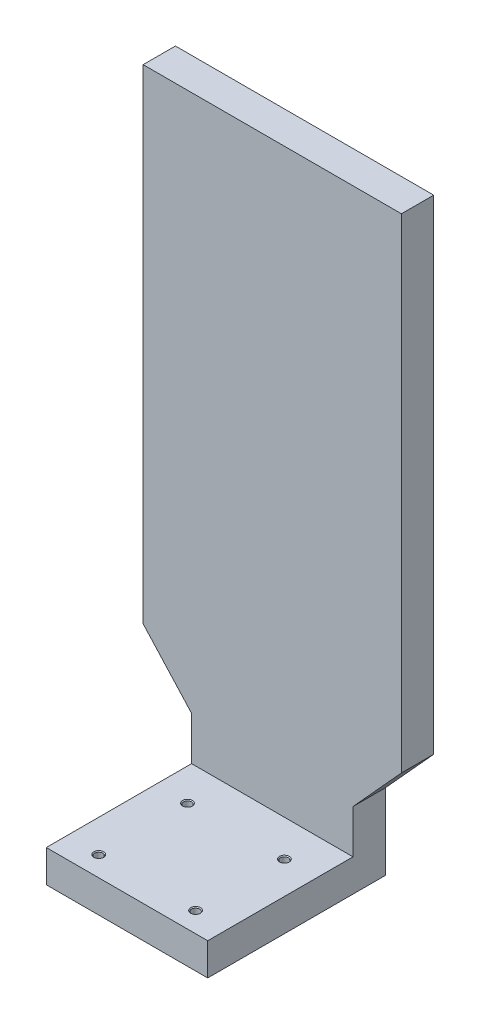
ISO-10303-21;
HEADER;
FILE_DESCRIPTION(('STEP AP214'),'2;1');
FILE_NAME('part.step','',(''),(''),'','','');
FILE_SCHEMA(('AUTOMOTIVE_DESIGN { 1 0 10303 214 1 1 1 1 }'));
ENDSEC;
DATA;
#1=APPLICATION_CONTEXT('core data for automotive mechanical design processes');
#2=APPLICATION_PROTOCOL_DEFINITION('international standard','automotive_design',2000,#1);
#3=PRODUCT_CONTEXT('',#1,'mechanical');
#4=PRODUCT('Part','Part','',(#3));
#5=PRODUCT_RELATED_PRODUCT_CATEGORY('part','',(#4));
#6=PRODUCT_DEFINITION_FORMATION('','',#4);
#7=PRODUCT_DEFINITION_CONTEXT('part definition',#1,'design');
#8=PRODUCT_DEFINITION('design','',#6,#7);
#9=PRODUCT_DEFINITION_SHAPE('','',#8);
#10=(LENGTH_UNIT() NAMED_UNIT(*) SI_UNIT(.MILLI.,.METRE.));
#11=(NAMED_UNIT(*) PLANE_ANGLE_UNIT() SI_UNIT($,.RADIAN.));
#12=(NAMED_UNIT(*) SI_UNIT($,.STERADIAN.) SOLID_ANGLE_UNIT());
#13=UNCERTAINTY_MEASURE_WITH_UNIT(LENGTH_MEASURE(1.E-05),#10,'distance_accuracy_value','');
#14=(GEOMETRIC_REPRESENTATION_CONTEXT(3) GLOBAL_UNCERTAINTY_ASSIGNED_CONTEXT((#13)) GLOBAL_UNIT_ASSIGNED_CONTEXT((#10,
#11,#12)) REPRESENTATION_CONTEXT('',''));
#15=CARTESIAN_POINT('',(0.,0.,0.));
#16=DIRECTION('',(0.,0.,1.));
#17=DIRECTION('',(1.,0.,0.));
#18=AXIS2_PLACEMENT_3D('',#15,#16,#17);
#19=CARTESIAN_POINT('',(0.,0.,20.));
#20=DIRECTION('',(-1.,0.,0.));
#21=DIRECTION('',(0.,0.,1.));
#22=AXIS2_PLACEMENT_3D('',#19,#20,#21);
#23=PLANE('',#22);
#24=DIRECTION('',(0.,1.,0.));
#25=VECTOR('',#24,1.);
#26=CARTESIAN_POINT('',(0.,0.,0.));
#27=LINE('',#26,#25);
#28=CARTESIAN_POINT('',(0.,0.,0.));
#29=VERTEX_POINT('',#28);
#30=CARTESIAN_POINT('',(0.,300.,0.));
#31=VERTEX_POINT('',#30);
#32=EDGE_CURVE('E126',#29,#31,#27,.T.);
#33=ORIENTED_EDGE('',*,*,#32,.F.);
#34=DIRECTION('',(0.,0.,-1.));
#35=VECTOR('',#34,1.);
#36=CARTESIAN_POINT('',(0.,0.,20.));
#37=LINE('',#36,#35);
#38=CARTESIAN_POINT('',(0.,0.,20.));
#39=VERTEX_POINT('',#38);
#40=EDGE_CURVE('E11',#39,#29,#37,.T.);
#41=ORIENTED_EDGE('',*,*,#40,.F.);
#42=DIRECTION('',(0.,1.,0.));
#43=VECTOR('',#42,1.);
#44=CARTESIAN_POINT('',(0.,0.,20.));
#45=LINE('',#44,#43);
#46=CARTESIAN_POINT('',(0.,300.,20.));
#47=VERTEX_POINT('',#46);
#48=EDGE_CURVE('E143',#39,#47,#45,.T.);
#49=ORIENTED_EDGE('',*,*,#48,.T.);
#50=DIRECTION('',(0.,0.,-1.));
#51=VECTOR('',#50,1.);
#52=CARTESIAN_POINT('',(0.,300.,20.));
#53=LINE('',#52,#51);
#54=EDGE_CURVE('E54',#47,#31,#53,.T.);
#55=ORIENTED_EDGE('',*,*,#54,.T.);
#56=EDGE_LOOP('',(#33,#41,#49,#55));
#57=FACE_BOUND('',#56,.T.);
#58=ADVANCED_FACE('F38',(#57),#23,.T.);
#59=CARTESIAN_POINT('',(0.,0.,20.));
#60=DIRECTION('',(0.739940073395944,0.672672793996313,0.));
#61=DIRECTION('',(-0.672672793996313,0.739940073395944,0.));
#62=AXIS2_PLACEMENT_3D('',#59,#60,#61);
#63=PLANE('',#62);
#64=DIRECTION('',(0.672672793996313,-0.739940073395944,0.));
#65=VECTOR('',#64,1.);
#66=CARTESIAN_POINT('',(0.,0.,0.));
#67=LINE('',#66,#65);
#68=CARTESIAN_POINT('',(30.,-33.,0.));
#69=VERTEX_POINT('',#68);
#70=EDGE_CURVE('E128',#29,#69,#67,.T.);
#71=ORIENTED_EDGE('',*,*,#70,.T.);
#72=DIRECTION('',(0.,0.,-1.));
#73=VECTOR('',#72,1.);
#74=CARTESIAN_POINT('',(30.,-33.,20.));
#75=LINE('',#74,#73);
#76=CARTESIAN_POINT('',(30.,-33.,20.));
#77=VERTEX_POINT('',#76);
#78=EDGE_CURVE('E46',#77,#69,#75,.T.);
#79=ORIENTED_EDGE('',*,*,#78,.F.);
#80=DIRECTION('',(0.672672793996313,-0.739940073395944,0.));
#81=VECTOR('',#80,1.);
#82=CARTESIAN_POINT('',(0.,0.,20.));
#83=LINE('',#82,#81);
#84=EDGE_CURVE('E190',#39,#77,#83,.T.);
#85=ORIENTED_EDGE('',*,*,#84,.F.);
#86=ORIENTED_EDGE('',*,*,#40,.T.);
#87=EDGE_LOOP('',(#71,#79,#85,#86));
#88=FACE_BOUND('',#87,.T.);
#89=ADVANCED_FACE('F211',(#88),#63,.F.);
#90=CARTESIAN_POINT('',(30.,0.,20.));
#91=DIRECTION('',(1.,0.,0.));
#92=DIRECTION('',(0.,1.,0.));
#93=AXIS2_PLACEMENT_3D('',#90,#91,#92);
#94=PLANE('',#93);
#95=DIRECTION('',(0.,-1.,0.));
#96=VECTOR('',#95,1.);
#97=CARTESIAN_POINT('',(30.,0.,0.));
#98=LINE('',#97,#96);
#99=CARTESIAN_POINT('',(30.,-80.,0.));
#100=VERTEX_POINT('',#99);
#101=EDGE_CURVE('E131',#69,#100,#98,.T.);
#102=ORIENTED_EDGE('',*,*,#101,.T.);
#103=DIRECTION('',(0.,0.,1.));
#104=VECTOR('',#103,1.);
#105=CARTESIAN_POINT('',(30.,-80.,-101.980390271856));
#106=LINE('',#105,#104);
#107=CARTESIAN_POINT('',(30.,-80.,110.));
#108=VERTEX_POINT('',#107);
#109=EDGE_CURVE('E172',#100,#108,#106,.T.);
#110=ORIENTED_EDGE('',*,*,#109,.T.);
#111=DIRECTION('',(0.,-1.,0.));
#112=VECTOR('',#111,1.);
#113=CARTESIAN_POINT('',(30.,-60.,110.));
#114=LINE('',#113,#112);
#115=CARTESIAN_POINT('',(30.,-60.,110.));
#116=VERTEX_POINT('',#115);
#117=EDGE_CURVE('E422',#116,#108,#114,.T.);
#118=ORIENTED_EDGE('',*,*,#117,.F.);
#119=DIRECTION('',(0.,0.,1.));
#120=VECTOR('',#119,1.);
#121=CARTESIAN_POINT('',(30.,-60.,-101.980390271856));
#122=LINE('',#121,#120);
#123=CARTESIAN_POINT('',(30.,-60.,20.));
#124=VERTEX_POINT('',#123);
#125=EDGE_CURVE('E169',#124,#116,#122,.T.);
#126=ORIENTED_EDGE('',*,*,#125,.F.);
#127=DIRECTION('',(0.,-1.,0.));
#128=VECTOR('',#127,1.);
#129=CARTESIAN_POINT('',(30.,0.,20.));
#130=LINE('',#129,#128);
#131=EDGE_CURVE('E157',#77,#124,#130,.T.);
#132=ORIENTED_EDGE('',*,*,#131,.F.);
#133=ORIENTED_EDGE('',*,*,#78,.T.);
#134=EDGE_LOOP('',(#102,#110,#118,#126,#132,#133));
#135=FACE_BOUND('',#134,.T.);
#136=ADVANCED_FACE('F151',(#135),#94,.F.);
#137=CARTESIAN_POINT('',(130.,0.,20.));
#138=DIRECTION('',(1.,0.,0.));
#139=DIRECTION('',(0.,0.,-1.));
#140=AXIS2_PLACEMENT_3D('',#137,#138,#139);
#141=PLANE('',#140);
#142=DIRECTION('',(0.,-1.,0.));
#143=VECTOR('',#142,1.);
#144=CARTESIAN_POINT('',(130.,0.,0.));
#145=LINE('',#144,#143);
#146=CARTESIAN_POINT('',(130.,-33.,0.));
#147=VERTEX_POINT('',#146);
#148=CARTESIAN_POINT('',(130.,-80.,0.));
#149=VERTEX_POINT('',#148);
#150=EDGE_CURVE('E134',#147,#149,#145,.T.);
#151=ORIENTED_EDGE('',*,*,#150,.F.);
#152=DIRECTION('',(0.,0.,-1.));
#153=VECTOR('',#152,1.);
#154=CARTESIAN_POINT('',(130.,-33.,20.));
#155=LINE('',#154,#153);
#156=CARTESIAN_POINT('',(130.,-33.,20.));
#157=VERTEX_POINT('',#156);
#158=EDGE_CURVE('E118',#157,#147,#155,.T.);
#159=ORIENTED_EDGE('',*,*,#158,.F.);
#160=DIRECTION('',(0.,-1.,0.));
#161=VECTOR('',#160,1.);
#162=CARTESIAN_POINT('',(130.,0.,20.));
#163=LINE('',#162,#161);
#164=CARTESIAN_POINT('',(130.,-60.,20.));
#165=VERTEX_POINT('',#164);
#166=EDGE_CURVE('E108',#157,#165,#163,.T.);
#167=ORIENTED_EDGE('',*,*,#166,.T.);
#168=DIRECTION('',(0.,0.,1.));
#169=VECTOR('',#168,1.);
#170=CARTESIAN_POINT('',(130.,-60.,-101.980390271856));
#171=LINE('',#170,#169);
#172=CARTESIAN_POINT('',(130.,-60.,110.));
#173=VERTEX_POINT('',#172);
#174=EDGE_CURVE('E182',#165,#173,#171,.T.);
#175=ORIENTED_EDGE('',*,*,#174,.T.);
#176=DIRECTION('',(0.,1.,0.));
#177=VECTOR('',#176,1.);
#178=CARTESIAN_POINT('',(130.,-60.,110.));
#179=LINE('',#178,#177);
#180=CARTESIAN_POINT('',(130.,-80.,110.));
#181=VERTEX_POINT('',#180);
#182=EDGE_CURVE('E185',#181,#173,#179,.T.);
#183=ORIENTED_EDGE('',*,*,#182,.F.);
#184=DIRECTION('',(0.,0.,1.));
#185=VECTOR('',#184,1.);
#186=CARTESIAN_POINT('',(130.,-80.,-101.980390271856));
#187=LINE('',#186,#185);
#188=EDGE_CURVE('E179',#149,#181,#187,.T.);
#189=ORIENTED_EDGE('',*,*,#188,.F.);
#190=EDGE_LOOP('',(#151,#159,#167,#175,#183,#189));
#191=FACE_BOUND('',#190,.T.);
#192=ADVANCED_FACE('F196',(#191),#141,.T.);
#193=CARTESIAN_POINT('',(87.6018099547511,-79.6380090497738,20.));
#194=DIRECTION('',(-0.739940073395944,0.672672793996313,0.));
#195=DIRECTION('',(-0.672672793996313,-0.739940073395944,0.));
#196=AXIS2_PLACEMENT_3D('',#193,#194,#195);
#197=PLANE('',#196);
#198=DIRECTION('',(0.672672793996313,0.739940073395944,0.));
#199=VECTOR('',#198,1.);
#200=CARTESIAN_POINT('',(87.6018099547511,-79.6380090497738,0.));
#201=LINE('',#200,#199);
#202=CARTESIAN_POINT('',(160.,0.,0.));
#203=VERTEX_POINT('',#202);
#204=EDGE_CURVE('E115',#147,#203,#201,.T.);
#205=ORIENTED_EDGE('',*,*,#204,.T.);
#206=DIRECTION('',(0.,0.,-1.));
#207=VECTOR('',#206,1.);
#208=CARTESIAN_POINT('',(160.,0.,20.));
#209=LINE('',#208,#207);
#210=CARTESIAN_POINT('',(160.,0.,20.));
#211=VERTEX_POINT('',#210);
#212=EDGE_CURVE('E112',#211,#203,#209,.T.);
#213=ORIENTED_EDGE('',*,*,#212,.F.);
#214=DIRECTION('',(0.672672793996313,0.739940073395944,0.));
#215=VECTOR('',#214,1.);
#216=CARTESIAN_POINT('',(87.6018099547511,-79.6380090497738,20.));
#217=LINE('',#216,#215);
#218=EDGE_CURVE('E99',#157,#211,#217,.T.);
#219=ORIENTED_EDGE('',*,*,#218,.F.);
#220=ORIENTED_EDGE('',*,*,#158,.T.);
#221=EDGE_LOOP('',(#205,#213,#219,#220));
#222=FACE_BOUND('',#221,.T.);
#223=ADVANCED_FACE('F113',(#222),#197,.F.);
#224=CARTESIAN_POINT('',(160.,0.,20.));
#225=DIRECTION('',(-1.,0.,0.));
#226=DIRECTION('',(0.,0.,1.));
#227=AXIS2_PLACEMENT_3D('',#224,#225,#226);
#228=PLANE('',#227);
#229=DIRECTION('',(0.,1.,0.));
#230=VECTOR('',#229,1.);
#231=CARTESIAN_POINT('',(160.,0.,0.));
#232=LINE('',#231,#230);
#233=CARTESIAN_POINT('',(160.,300.,0.));
#234=VERTEX_POINT('',#233);
#235=EDGE_CURVE('E138',#203,#234,#232,.T.);
#236=ORIENTED_EDGE('',*,*,#235,.T.);
#237=DIRECTION('',(0.,0.,-1.));
#238=VECTOR('',#237,1.);
#239=CARTESIAN_POINT('',(160.,300.,20.));
#240=LINE('',#239,#238);
#241=CARTESIAN_POINT('',(160.,300.,20.));
#242=VERTEX_POINT('',#241);
#243=EDGE_CURVE('E75',#242,#234,#240,.T.);
#244=ORIENTED_EDGE('',*,*,#243,.F.);
#245=DIRECTION('',(0.,1.,0.));
#246=VECTOR('',#245,1.);
#247=CARTESIAN_POINT('',(160.,0.,20.));
#248=LINE('',#247,#246);
#249=EDGE_CURVE('E105',#211,#242,#248,.T.);
#250=ORIENTED_EDGE('',*,*,#249,.F.);
#251=ORIENTED_EDGE('',*,*,#212,.T.);
#252=EDGE_LOOP('',(#236,#244,#250,#251));
#253=FACE_BOUND('',#252,.T.);
#254=ADVANCED_FACE('F120',(#253),#228,.F.);
#255=CARTESIAN_POINT('',(0.,300.,20.));
#256=DIRECTION('',(0.,1.,0.));
#257=DIRECTION('',(0.,0.,1.));
#258=AXIS2_PLACEMENT_3D('',#255,#256,#257);
#259=PLANE('',#258);
#260=DIRECTION('',(1.,0.,0.));
#261=VECTOR('',#260,1.);
#262=CARTESIAN_POINT('',(0.,300.,0.));
#263=LINE('',#262,#261);
#264=EDGE_CURVE('E140',#31,#234,#263,.T.);
#265=ORIENTED_EDGE('',*,*,#264,.F.);
#266=ORIENTED_EDGE('',*,*,#54,.F.);
#267=DIRECTION('',(1.,0.,0.));
#268=VECTOR('',#267,1.);
#269=CARTESIAN_POINT('',(0.,300.,20.));
#270=LINE('',#269,#268);
#271=EDGE_CURVE('E121',#47,#242,#270,.T.);
#272=ORIENTED_EDGE('',*,*,#271,.T.);
#273=ORIENTED_EDGE('',*,*,#243,.T.);
#274=EDGE_LOOP('',(#265,#266,#272,#273));
#275=FACE_BOUND('',#274,.T.);
#276=ADVANCED_FACE('F200',(#275),#259,.T.);
#277=CARTESIAN_POINT('',(0.,0.,20.));
#278=DIRECTION('',(0.,0.,1.));
#279=DIRECTION('',(1.,0.,0.));
#280=AXIS2_PLACEMENT_3D('',#277,#278,#279);
#281=PLANE('',#280);
#282=ORIENTED_EDGE('',*,*,#48,.F.);
#283=ORIENTED_EDGE('',*,*,#84,.T.);
#284=ORIENTED_EDGE('',*,*,#131,.T.);
#285=DIRECTION('',(1.,0.,0.));
#286=VECTOR('',#285,1.);
#287=CARTESIAN_POINT('',(0.,-60.,20.));
#288=LINE('',#287,#286);
#289=EDGE_CURVE('E193',#124,#165,#288,.T.);
#290=ORIENTED_EDGE('',*,*,#289,.T.);
#291=ORIENTED_EDGE('',*,*,#166,.F.);
#292=ORIENTED_EDGE('',*,*,#218,.T.);
#293=ORIENTED_EDGE('',*,*,#249,.T.);
#294=ORIENTED_EDGE('',*,*,#271,.F.);
#295=EDGE_LOOP('',(#282,#283,#284,#290,#291,#292,#293,#294));
#296=FACE_BOUND('',#295,.T.);
#297=ADVANCED_FACE('F102',(#296),#281,.T.);
#298=CARTESIAN_POINT('',(0.,0.,0.));
#299=DIRECTION('',(0.,0.,1.));
#300=DIRECTION('',(1.,0.,0.));
#301=AXIS2_PLACEMENT_3D('',#298,#299,#300);
#302=PLANE('',#301);
#303=ORIENTED_EDGE('',*,*,#32,.T.);
#304=ORIENTED_EDGE('',*,*,#264,.T.);
#305=ORIENTED_EDGE('',*,*,#235,.F.);
#306=ORIENTED_EDGE('',*,*,#204,.F.);
#307=ORIENTED_EDGE('',*,*,#150,.T.);
#308=DIRECTION('',(-1.,0.,0.));
#309=VECTOR('',#308,1.);
#310=CARTESIAN_POINT('',(30.,-80.,0.));
#311=LINE('',#310,#309);
#312=EDGE_CURVE('E129',#149,#100,#311,.T.);
#313=ORIENTED_EDGE('',*,*,#312,.T.);
#314=ORIENTED_EDGE('',*,*,#101,.F.);
#315=ORIENTED_EDGE('',*,*,#70,.F.);
#316=EDGE_LOOP('',(#303,#304,#305,#306,#307,#313,#314,#315));
#317=FACE_BOUND('',#316,.T.);
#318=ADVANCED_FACE('F161',(#317),#302,.F.);
#319=CARTESIAN_POINT('',(30.,-60.,-101.980390271856));
#320=DIRECTION('',(0.,1.,0.));
#321=DIRECTION('',(0.,0.,1.));
#322=AXIS2_PLACEMENT_3D('',#319,#320,#321);
#323=PLANE('',#322);
#324=CARTESIAN_POINT('',(50.,-60.,97.5));
#325=DIRECTION('',(0.,1.,0.));
#326=DIRECTION('',(0.,0.,1.));
#327=AXIS2_PLACEMENT_3D('',#324,#325,#326);
#328=CIRCLE('',#327,3.025);
#329=CARTESIAN_POINT('',(50.,-60.,100.525));
#330=VERTEX_POINT('',#329);
#331=EDGE_CURVE('E388',#330,#330,#328,.T.);
#332=ORIENTED_EDGE('',*,*,#331,.F.);
#333=EDGE_LOOP('',(#332));
#334=FACE_BOUND('',#333,.T.);
#335=CARTESIAN_POINT('',(110.,-60.,97.4999999999999));
#336=DIRECTION('',(0.,1.,0.));
#337=DIRECTION('',(0.,0.,1.));
#338=AXIS2_PLACEMENT_3D('',#335,#336,#337);
#339=CIRCLE('',#338,3.025);
#340=CARTESIAN_POINT('',(110.,-60.,100.525));
#341=VERTEX_POINT('',#340);
#342=EDGE_CURVE('E395',#341,#341,#339,.T.);
#343=ORIENTED_EDGE('',*,*,#342,.F.);
#344=EDGE_LOOP('',(#343));
#345=FACE_BOUND('',#344,.T.);
#346=CARTESIAN_POINT('',(110.,-60.,42.5));
#347=DIRECTION('',(0.,1.,0.));
#348=DIRECTION('',(0.,0.,1.));
#349=AXIS2_PLACEMENT_3D('',#346,#347,#348);
#350=CIRCLE('',#349,3.025);
#351=CARTESIAN_POINT('',(110.,-60.,45.525));
#352=VERTEX_POINT('',#351);
#353=EDGE_CURVE('E404',#352,#352,#350,.T.);
#354=ORIENTED_EDGE('',*,*,#353,.F.);
#355=EDGE_LOOP('',(#354));
#356=FACE_BOUND('',#355,.T.);
#357=CARTESIAN_POINT('',(50.,-60.,42.5));
#358=DIRECTION('',(0.,1.,0.));
#359=DIRECTION('',(0.,0.,1.));
#360=AXIS2_PLACEMENT_3D('',#357,#358,#359);
#361=CIRCLE('',#360,3.025);
#362=CARTESIAN_POINT('',(50.,-60.,45.525));
#363=VERTEX_POINT('',#362);
#364=EDGE_CURVE('E413',#363,#363,#361,.T.);
#365=ORIENTED_EDGE('',*,*,#364,.F.);
#366=EDGE_LOOP('',(#365));
#367=FACE_BOUND('',#366,.T.);
#368=ORIENTED_EDGE('',*,*,#289,.F.);
#369=ORIENTED_EDGE('',*,*,#125,.T.);
#370=DIRECTION('',(-1.,0.,0.));
#371=VECTOR('',#370,1.);
#372=CARTESIAN_POINT('',(30.,-60.,110.));
#373=LINE('',#372,#371);
#374=EDGE_CURVE('E180',#173,#116,#373,.T.);
#375=ORIENTED_EDGE('',*,*,#374,.F.);
#376=ORIENTED_EDGE('',*,*,#174,.F.);
#377=EDGE_LOOP('',(#368,#369,#375,#376));
#378=FACE_BOUND('',#377,.T.);
#379=ADVANCED_FACE('F266',(#334,#345,#356,#367,#378),#323,.T.);
#380=CARTESIAN_POINT('',(30.,-80.,-101.980390271856));
#381=DIRECTION('',(0.,-1.,0.));
#382=DIRECTION('',(0.,0.,-1.));
#383=AXIS2_PLACEMENT_3D('',#380,#381,#382);
#384=PLANE('',#383);
#385=CARTESIAN_POINT('',(50.,-80.,97.5));
#386=DIRECTION('',(0.,1.,0.));
#387=DIRECTION('',(0.,0.,1.));
#388=AXIS2_PLACEMENT_3D('',#385,#386,#387);
#389=CIRCLE('',#388,2.49999999999995);
#390=CARTESIAN_POINT('',(50.,-80.,99.9999999999999));
#391=VERTEX_POINT('',#390);
#392=EDGE_CURVE('E390',#391,#391,#389,.T.);
#393=ORIENTED_EDGE('',*,*,#392,.T.);
#394=EDGE_LOOP('',(#393));
#395=FACE_BOUND('',#394,.T.);
#396=CARTESIAN_POINT('',(110.,-80.,97.4999999999999));
#397=DIRECTION('',(0.,1.,0.));
#398=DIRECTION('',(0.,0.,1.));
#399=AXIS2_PLACEMENT_3D('',#396,#397,#398);
#400=CIRCLE('',#399,2.49999999999996);
#401=CARTESIAN_POINT('',(110.,-80.,99.9999999999999));
#402=VERTEX_POINT('',#401);
#403=EDGE_CURVE('E401',#402,#402,#400,.T.);
#404=ORIENTED_EDGE('',*,*,#403,.T.);
#405=EDGE_LOOP('',(#404));
#406=FACE_BOUND('',#405,.T.);
#407=CARTESIAN_POINT('',(110.,-80.,42.5));
#408=DIRECTION('',(0.,1.,0.));
#409=DIRECTION('',(0.,0.,1.));
#410=AXIS2_PLACEMENT_3D('',#407,#408,#409);
#411=CIRCLE('',#410,2.49999999999995);
#412=CARTESIAN_POINT('',(110.,-80.,44.9999999999999));
#413=VERTEX_POINT('',#412);
#414=EDGE_CURVE('E410',#413,#413,#411,.T.);
#415=ORIENTED_EDGE('',*,*,#414,.T.);
#416=EDGE_LOOP('',(#415));
#417=FACE_BOUND('',#416,.T.);
#418=CARTESIAN_POINT('',(50.,-80.,42.5));
#419=DIRECTION('',(0.,1.,0.));
#420=DIRECTION('',(0.,0.,1.));
#421=AXIS2_PLACEMENT_3D('',#418,#419,#420);
#422=CIRCLE('',#421,2.49999999999995);
#423=CARTESIAN_POINT('',(50.,-80.,44.9999999999999));
#424=VERTEX_POINT('',#423);
#425=EDGE_CURVE('E419',#424,#424,#422,.T.);
#426=ORIENTED_EDGE('',*,*,#425,.T.);
#427=EDGE_LOOP('',(#426));
#428=FACE_BOUND('',#427,.T.);
#429=ORIENTED_EDGE('',*,*,#312,.F.);
#430=ORIENTED_EDGE('',*,*,#188,.T.);
#431=DIRECTION('',(1.,0.,0.));
#432=VECTOR('',#431,1.);
#433=CARTESIAN_POINT('',(30.,-80.,110.));
#434=LINE('',#433,#432);
#435=EDGE_CURVE('E176',#108,#181,#434,.T.);
#436=ORIENTED_EDGE('',*,*,#435,.F.);
#437=ORIENTED_EDGE('',*,*,#109,.F.);
#438=EDGE_LOOP('',(#429,#430,#436,#437));
#439=FACE_BOUND('',#438,.T.);
#440=ADVANCED_FACE('F173',(#395,#406,#417,#428,#439),#384,.T.);
#441=CARTESIAN_POINT('',(0.,0.,110.));
#442=DIRECTION('',(0.,0.,1.));
#443=DIRECTION('',(1.,0.,0.));
#444=AXIS2_PLACEMENT_3D('',#441,#442,#443);
#445=PLANE('',#444);
#446=ORIENTED_EDGE('',*,*,#117,.T.);
#447=ORIENTED_EDGE('',*,*,#435,.T.);
#448=ORIENTED_EDGE('',*,*,#182,.T.);
#449=ORIENTED_EDGE('',*,*,#374,.T.);
#450=EDGE_LOOP('',(#446,#447,#448,#449));
#451=FACE_BOUND('',#450,.T.);
#452=ADVANCED_FACE('F272',(#451),#445,.T.);
#453=CARTESIAN_POINT('',(50.,-60.,42.5));
#454=DIRECTION('',(0.,1.,0.));
#455=DIRECTION('',(0.,0.,1.));
#456=AXIS2_PLACEMENT_3D('',#453,#454,#455);
#457=CYLINDRICAL_SURFACE('',#456,2.49999999999998);
#458=ORIENTED_EDGE('',*,*,#425,.F.);
#459=EDGE_LOOP('',(#458));
#460=FACE_BOUND('',#459,.T.);
#461=CARTESIAN_POINT('',(50.,-60.525,42.5));
#462=DIRECTION('',(0.,1.,0.));
#463=DIRECTION('',(0.,0.,1.));
#464=AXIS2_PLACEMENT_3D('',#461,#462,#463);
#465=CIRCLE('',#464,2.5);
#466=CARTESIAN_POINT('',(50.,-60.525,45.));
#467=VERTEX_POINT('',#466);
#468=EDGE_CURVE('E416',#467,#467,#465,.T.);
#469=ORIENTED_EDGE('',*,*,#468,.T.);
#470=EDGE_LOOP('',(#469));
#471=FACE_BOUND('',#470,.T.);
#472=ADVANCED_FACE('F277',(#460,#471),#457,.F.);
#473=CARTESIAN_POINT('',(50.,-60.,42.5));
#474=DIRECTION('',(0.,1.,0.));
#475=DIRECTION('',(0.,0.,1.));
#476=AXIS2_PLACEMENT_3D('',#473,#474,#475);
#477=CONICAL_SURFACE('',#476,3.025,0.785398163397448);
#478=ORIENTED_EDGE('',*,*,#468,.F.);
#479=EDGE_LOOP('',(#478));
#480=FACE_BOUND('',#479,.T.);
#481=ORIENTED_EDGE('',*,*,#364,.T.);
#482=EDGE_LOOP('',(#481));
#483=FACE_BOUND('',#482,.T.);
#484=ADVANCED_FACE('F304',(#480,#483),#477,.F.);
#485=CARTESIAN_POINT('',(110.,-60.,42.5));
#486=DIRECTION('',(0.,1.,0.));
#487=DIRECTION('',(0.,0.,1.));
#488=AXIS2_PLACEMENT_3D('',#485,#486,#487);
#489=CYLINDRICAL_SURFACE('',#488,2.49999999999997);
#490=ORIENTED_EDGE('',*,*,#414,.F.);
#491=EDGE_LOOP('',(#490));
#492=FACE_BOUND('',#491,.T.);
#493=CARTESIAN_POINT('',(110.,-60.525,42.5));
#494=DIRECTION('',(0.,1.,0.));
#495=DIRECTION('',(0.,0.,1.));
#496=AXIS2_PLACEMENT_3D('',#493,#494,#495);
#497=CIRCLE('',#496,2.5);
#498=CARTESIAN_POINT('',(110.,-60.525,45.));
#499=VERTEX_POINT('',#498);
#500=EDGE_CURVE('E407',#499,#499,#497,.T.);
#501=ORIENTED_EDGE('',*,*,#500,.T.);
#502=EDGE_LOOP('',(#501));
#503=FACE_BOUND('',#502,.T.);
#504=ADVANCED_FACE('F315',(#492,#503),#489,.F.);
#505=CARTESIAN_POINT('',(110.,-60.,42.5));
#506=DIRECTION('',(0.,1.,0.));
#507=DIRECTION('',(0.,0.,1.));
#508=AXIS2_PLACEMENT_3D('',#505,#506,#507);
#509=CONICAL_SURFACE('',#508,3.025,0.785398163397448);
#510=ORIENTED_EDGE('',*,*,#500,.F.);
#511=EDGE_LOOP('',(#510));
#512=FACE_BOUND('',#511,.T.);
#513=ORIENTED_EDGE('',*,*,#353,.T.);
#514=EDGE_LOOP('',(#513));
#515=FACE_BOUND('',#514,.T.);
#516=ADVANCED_FACE('F325',(#512,#515),#509,.F.);
#517=CARTESIAN_POINT('',(110.,-60.,97.4999999999999));
#518=DIRECTION('',(0.,1.,0.));
#519=DIRECTION('',(0.,0.,1.));
#520=AXIS2_PLACEMENT_3D('',#517,#518,#519);
#521=CYLINDRICAL_SURFACE('',#520,2.49999999999998);
#522=ORIENTED_EDGE('',*,*,#403,.F.);
#523=EDGE_LOOP('',(#522));
#524=FACE_BOUND('',#523,.T.);
#525=CARTESIAN_POINT('',(110.,-60.525,97.4999999999999));
#526=DIRECTION('',(0.,1.,0.));
#527=DIRECTION('',(0.,0.,1.));
#528=AXIS2_PLACEMENT_3D('',#525,#526,#527);
#529=CIRCLE('',#528,2.5);
#530=CARTESIAN_POINT('',(110.,-60.525,99.9999999999999));
#531=VERTEX_POINT('',#530);
#532=EDGE_CURVE('E398',#531,#531,#529,.T.);
#533=ORIENTED_EDGE('',*,*,#532,.T.);
#534=EDGE_LOOP('',(#533));
#535=FACE_BOUND('',#534,.T.);
#536=ADVANCED_FACE('F336',(#524,#535),#521,.F.);
#537=CARTESIAN_POINT('',(110.,-60.,97.4999999999999));
#538=DIRECTION('',(0.,1.,0.));
#539=DIRECTION('',(0.,0.,1.));
#540=AXIS2_PLACEMENT_3D('',#537,#538,#539);
#541=CONICAL_SURFACE('',#540,3.025,0.785398163397448);
#542=ORIENTED_EDGE('',*,*,#532,.F.);
#543=EDGE_LOOP('',(#542));
#544=FACE_BOUND('',#543,.T.);
#545=ORIENTED_EDGE('',*,*,#342,.T.);
#546=EDGE_LOOP('',(#545));
#547=FACE_BOUND('',#546,.T.);
#548=ADVANCED_FACE('F346',(#544,#547),#541,.F.);
#549=CARTESIAN_POINT('',(50.,-60.,97.5));
#550=DIRECTION('',(0.,1.,0.));
#551=DIRECTION('',(0.,0.,1.));
#552=AXIS2_PLACEMENT_3D('',#549,#550,#551);
#553=CYLINDRICAL_SURFACE('',#552,2.49999999999998);
#554=ORIENTED_EDGE('',*,*,#392,.F.);
#555=EDGE_LOOP('',(#554));
#556=FACE_BOUND('',#555,.T.);
#557=CARTESIAN_POINT('',(50.,-60.525,97.5));
#558=DIRECTION('',(0.,1.,0.));
#559=DIRECTION('',(0.,0.,1.));
#560=AXIS2_PLACEMENT_3D('',#557,#558,#559);
#561=CIRCLE('',#560,2.5);
#562=CARTESIAN_POINT('',(50.,-60.525,100.));
#563=VERTEX_POINT('',#562);
#564=EDGE_CURVE('E385',#563,#563,#561,.T.);
#565=ORIENTED_EDGE('',*,*,#564,.T.);
#566=EDGE_LOOP('',(#565));
#567=FACE_BOUND('',#566,.T.);
#568=ADVANCED_FACE('F357',(#556,#567),#553,.F.);
#569=CARTESIAN_POINT('',(50.,-60.,97.5));
#570=DIRECTION('',(0.,1.,0.));
#571=DIRECTION('',(0.,0.,1.));
#572=AXIS2_PLACEMENT_3D('',#569,#570,#571);
#573=CONICAL_SURFACE('',#572,3.025,0.785398163397448);
#574=ORIENTED_EDGE('',*,*,#564,.F.);
#575=EDGE_LOOP('',(#574));
#576=FACE_BOUND('',#575,.T.);
#577=ORIENTED_EDGE('',*,*,#331,.T.);
#578=EDGE_LOOP('',(#577));
#579=FACE_BOUND('',#578,.T.);
#580=ADVANCED_FACE('F367',(#576,#579),#573,.F.);
#581=CLOSED_SHELL('',(#58,#89,#136,#192,#223,#254,#276,#297,#318,#379,#440,#452,#472,#484,#504,
#516,#536,#548,#568,#580));
#582=MANIFOLD_SOLID_BREP('B2',#581);
#583=ADVANCED_BREP_SHAPE_REPRESENTATION('',(#18,#582),#14);
#584=SHAPE_DEFINITION_REPRESENTATION(#9,#583);
ENDSEC;
END-ISO-10303-21;
